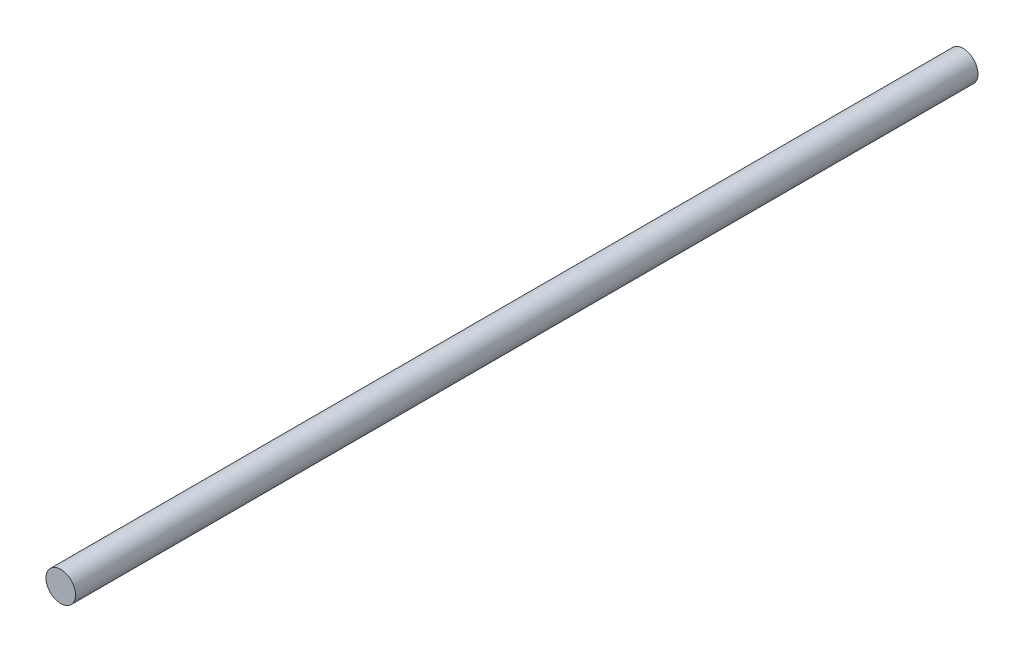
ISO-10303-21;
HEADER;
FILE_DESCRIPTION(('STEP AP214'),'2;1');
FILE_NAME('part.step','',(''),(''),'','','');
FILE_SCHEMA(('AUTOMOTIVE_DESIGN { 1 0 10303 214 1 1 1 1 }'));
ENDSEC;
DATA;
#1=APPLICATION_CONTEXT('core data for automotive mechanical design processes');
#2=APPLICATION_PROTOCOL_DEFINITION('international standard','automotive_design',2000,#1);
#3=PRODUCT_CONTEXT('',#1,'mechanical');
#4=PRODUCT('Part','Part','',(#3));
#5=PRODUCT_RELATED_PRODUCT_CATEGORY('part','',(#4));
#6=PRODUCT_DEFINITION_FORMATION('','',#4);
#7=PRODUCT_DEFINITION_CONTEXT('part definition',#1,'design');
#8=PRODUCT_DEFINITION('design','',#6,#7);
#9=PRODUCT_DEFINITION_SHAPE('','',#8);
#10=(LENGTH_UNIT() NAMED_UNIT(*) SI_UNIT(.MILLI.,.METRE.));
#11=(NAMED_UNIT(*) PLANE_ANGLE_UNIT() SI_UNIT($,.RADIAN.));
#12=(NAMED_UNIT(*) SI_UNIT($,.STERADIAN.) SOLID_ANGLE_UNIT());
#13=UNCERTAINTY_MEASURE_WITH_UNIT(LENGTH_MEASURE(1.E-05),#10,'distance_accuracy_value','');
#14=(GEOMETRIC_REPRESENTATION_CONTEXT(3) GLOBAL_UNCERTAINTY_ASSIGNED_CONTEXT((#13)) GLOBAL_UNIT_ASSIGNED_CONTEXT((#10,
#11,#12)) REPRESENTATION_CONTEXT('',''));
#15=CARTESIAN_POINT('',(0.,0.,0.));
#16=DIRECTION('',(0.,0.,1.));
#17=DIRECTION('',(1.,0.,0.));
#18=AXIS2_PLACEMENT_3D('',#15,#16,#17);
#19=CARTESIAN_POINT('',(0.,0.,774.7));
#20=DIRECTION('',(0.,0.,-1.));
#21=DIRECTION('',(-1.,0.,0.));
#22=AXIS2_PLACEMENT_3D('',#19,#20,#21);
#23=CYLINDRICAL_SURFACE('',#22,12.7);
#24=CARTESIAN_POINT('',(0.,0.,774.7));
#25=DIRECTION('',(0.,0.,1.));
#26=DIRECTION('',(1.,0.,0.));
#27=AXIS2_PLACEMENT_3D('',#24,#25,#26);
#28=CIRCLE('',#27,12.7);
#29=CARTESIAN_POINT('',(12.7,0.,774.7));
#30=VERTEX_POINT('',#29);
#31=EDGE_CURVE('E10',#30,#30,#28,.T.);
#32=ORIENTED_EDGE('',*,*,#31,.F.);
#33=EDGE_LOOP('',(#32));
#34=FACE_BOUND('',#33,.T.);
#35=CARTESIAN_POINT('',(0.,0.,0.));
#36=DIRECTION('',(0.,0.,1.));
#37=DIRECTION('',(1.,0.,0.));
#38=AXIS2_PLACEMENT_3D('',#35,#36,#37);
#39=CIRCLE('',#38,12.7);
#40=CARTESIAN_POINT('',(12.7,0.,0.));
#41=VERTEX_POINT('',#40);
#42=EDGE_CURVE('E31',#41,#41,#39,.T.);
#43=ORIENTED_EDGE('',*,*,#42,.T.);
#44=EDGE_LOOP('',(#43));
#45=FACE_BOUND('',#44,.T.);
#46=ADVANCED_FACE('F28',(#34,#45),#23,.T.);
#47=CARTESIAN_POINT('',(0.,0.,774.7));
#48=DIRECTION('',(0.,0.,1.));
#49=DIRECTION('',(1.,0.,0.));
#50=AXIS2_PLACEMENT_3D('',#47,#48,#49);
#51=PLANE('',#50);
#52=ORIENTED_EDGE('',*,*,#31,.T.);
#53=EDGE_LOOP('',(#52));
#54=FACE_BOUND('',#53,.T.);
#55=ADVANCED_FACE('F43',(#54),#51,.T.);
#56=CARTESIAN_POINT('',(0.,0.,0.));
#57=DIRECTION('',(0.,0.,1.));
#58=DIRECTION('',(1.,0.,0.));
#59=AXIS2_PLACEMENT_3D('',#56,#57,#58);
#60=PLANE('',#59);
#61=ORIENTED_EDGE('',*,*,#42,.F.);
#62=EDGE_LOOP('',(#61));
#63=FACE_BOUND('',#62,.T.);
#64=ADVANCED_FACE('F41',(#63),#60,.F.);
#65=CLOSED_SHELL('',(#46,#55,#64));
#66=MANIFOLD_SOLID_BREP('B2',#65);
#67=ADVANCED_BREP_SHAPE_REPRESENTATION('',(#18,#66),#14);
#68=SHAPE_DEFINITION_REPRESENTATION(#9,#67);
ENDSEC;
END-ISO-10303-21;
